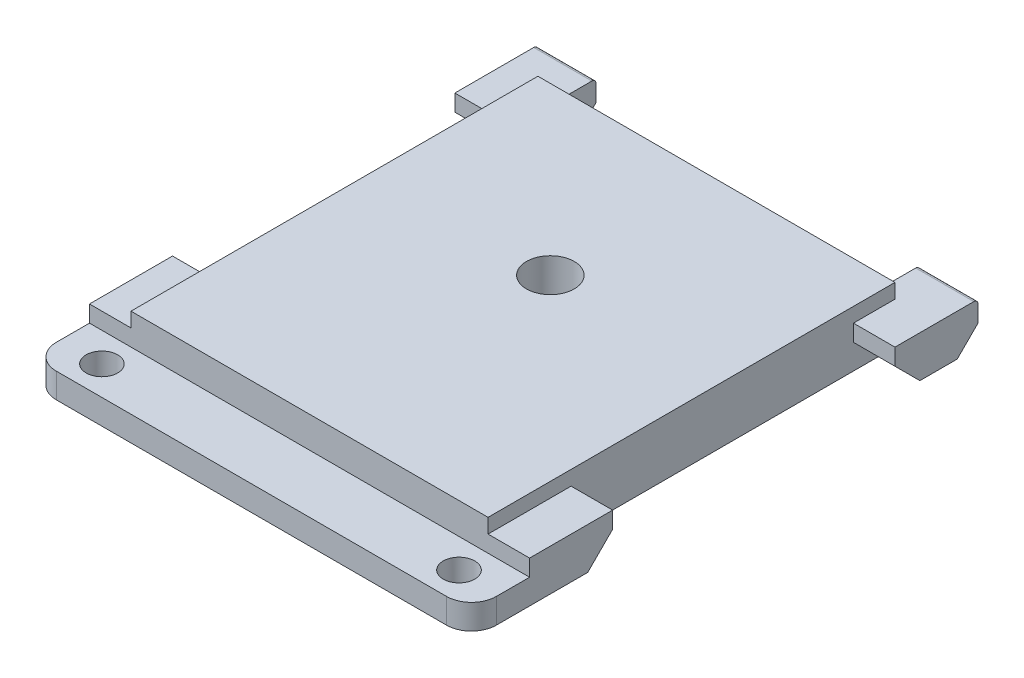
ISO-10303-21;
HEADER;
FILE_DESCRIPTION(('STEP AP214'),'2;1');
FILE_NAME('part.step','',(''),(''),'','','');
FILE_SCHEMA(('AUTOMOTIVE_DESIGN { 1 0 10303 214 1 1 1 1 }'));
ENDSEC;
DATA;
#1=APPLICATION_CONTEXT('core data for automotive mechanical design processes');
#2=APPLICATION_PROTOCOL_DEFINITION('international standard','automotive_design',2000,#1);
#3=PRODUCT_CONTEXT('',#1,'mechanical');
#4=PRODUCT('Part','Part','',(#3));
#5=PRODUCT_RELATED_PRODUCT_CATEGORY('part','',(#4));
#6=PRODUCT_DEFINITION_FORMATION('','',#4);
#7=PRODUCT_DEFINITION_CONTEXT('part definition',#1,'design');
#8=PRODUCT_DEFINITION('design','',#6,#7);
#9=PRODUCT_DEFINITION_SHAPE('','',#8);
#10=(LENGTH_UNIT() NAMED_UNIT(*) SI_UNIT(.MILLI.,.METRE.));
#11=(NAMED_UNIT(*) PLANE_ANGLE_UNIT() SI_UNIT($,.RADIAN.));
#12=(NAMED_UNIT(*) SI_UNIT($,.STERADIAN.) SOLID_ANGLE_UNIT());
#13=UNCERTAINTY_MEASURE_WITH_UNIT(LENGTH_MEASURE(1.E-05),#10,'distance_accuracy_value','');
#14=(GEOMETRIC_REPRESENTATION_CONTEXT(3) GLOBAL_UNCERTAINTY_ASSIGNED_CONTEXT((#13)) GLOBAL_UNIT_ASSIGNED_CONTEXT((#10,
#11,#12)) REPRESENTATION_CONTEXT('',''));
#15=CARTESIAN_POINT('',(0.,0.,0.));
#16=DIRECTION('',(0.,0.,1.));
#17=DIRECTION('',(1.,0.,0.));
#18=AXIS2_PLACEMENT_3D('',#15,#16,#17);
#19=CARTESIAN_POINT('',(0.,0.,0.));
#20=DIRECTION('',(0.,1.,0.));
#21=DIRECTION('',(0.,0.,1.));
#22=AXIS2_PLACEMENT_3D('',#19,#20,#21);
#23=PLANE('',#22);
#24=CARTESIAN_POINT('',(21.5,0.,20.));
#25=DIRECTION('',(0.,1.,0.));
#26=DIRECTION('',(0.,0.,1.));
#27=AXIS2_PLACEMENT_3D('',#24,#25,#26);
#28=CIRCLE('',#27,2.875);
#29=CARTESIAN_POINT('',(21.5,0.,22.875));
#30=VERTEX_POINT('',#29);
#31=EDGE_CURVE('E303',#30,#30,#28,.T.);
#32=ORIENTED_EDGE('',*,*,#31,.T.);
#33=EDGE_LOOP('',(#32));
#34=FACE_BOUND('',#33,.T.);
#35=CARTESIAN_POINT('',(0.,0.,52.5));
#36=DIRECTION('',(0.,1.,0.));
#37=DIRECTION('',(0.,0.,1.));
#38=AXIS2_PLACEMENT_3D('',#35,#36,#37);
#39=CIRCLE('',#38,1.9);
#40=CARTESIAN_POINT('',(0.,0.,54.4));
#41=VERTEX_POINT('',#40);
#42=EDGE_CURVE('E527',#41,#41,#39,.F.);
#43=ORIENTED_EDGE('',*,*,#42,.F.);
#44=EDGE_LOOP('',(#43));
#45=FACE_BOUND('',#44,.T.);
#46=CARTESIAN_POINT('',(43.,0.,52.5));
#47=DIRECTION('',(0.,1.,0.));
#48=DIRECTION('',(0.,0.,1.));
#49=AXIS2_PLACEMENT_3D('',#46,#47,#48);
#50=CIRCLE('',#49,1.9);
#51=CARTESIAN_POINT('',(43.,0.,54.4));
#52=VERTEX_POINT('',#51);
#53=EDGE_CURVE('E526',#52,#52,#50,.F.);
#54=ORIENTED_EDGE('',*,*,#53,.F.);
#55=EDGE_LOOP('',(#54));
#56=FACE_BOUND('',#55,.T.);
#57=DIRECTION('',(0.,0.,-1.));
#58=VECTOR('',#57,1.);
#59=CARTESIAN_POINT('',(48.,0.,49.));
#60=LINE('',#59,#58);
#61=CARTESIAN_POINT('',(48.,0.,53.));
#62=VERTEX_POINT('',#61);
#63=CARTESIAN_POINT('',(48.,0.,42.));
#64=VERTEX_POINT('',#63);
#65=EDGE_CURVE('E280',#62,#64,#60,.T.);
#66=ORIENTED_EDGE('',*,*,#65,.F.);
#67=CARTESIAN_POINT('',(45.,0.,53.));
#68=DIRECTION('',(0.,1.,0.));
#69=DIRECTION('',(0.,0.,1.));
#70=AXIS2_PLACEMENT_3D('',#67,#68,#69);
#71=CIRCLE('',#70,3.);
#72=CARTESIAN_POINT('',(45.,0.,56.));
#73=VERTEX_POINT('',#72);
#74=EDGE_CURVE('E47',#62,#73,#71,.F.);
#75=ORIENTED_EDGE('',*,*,#74,.T.);
#76=DIRECTION('',(1.,0.,0.));
#77=VECTOR('',#76,1.);
#78=CARTESIAN_POINT('',(-4.99999999999999,0.,56.));
#79=LINE('',#78,#77);
#80=CARTESIAN_POINT('',(-1.99999999999999,0.,56.));
#81=VERTEX_POINT('',#80);
#82=EDGE_CURVE('E425',#81,#73,#79,.T.);
#83=ORIENTED_EDGE('',*,*,#82,.F.);
#84=CARTESIAN_POINT('',(-1.99999999999999,0.,53.));
#85=DIRECTION('',(0.,1.,0.));
#86=DIRECTION('',(0.,0.,1.));
#87=AXIS2_PLACEMENT_3D('',#84,#85,#86);
#88=CIRCLE('',#87,3.);
#89=CARTESIAN_POINT('',(-4.99999999999999,0.,53.));
#90=VERTEX_POINT('',#89);
#91=EDGE_CURVE('E54',#81,#90,#88,.F.);
#92=ORIENTED_EDGE('',*,*,#91,.T.);
#93=DIRECTION('',(0.,0.,1.));
#94=VECTOR('',#93,1.);
#95=CARTESIAN_POINT('',(-5.,0.,0.));
#96=LINE('',#95,#94);
#97=CARTESIAN_POINT('',(-4.99999999999999,0.,42.));
#98=VERTEX_POINT('',#97);
#99=EDGE_CURVE('E291',#98,#90,#96,.T.);
#100=ORIENTED_EDGE('',*,*,#99,.F.);
#101=DIRECTION('',(1.,0.,0.));
#102=VECTOR('',#101,1.);
#103=CARTESIAN_POINT('',(0.,0.,42.));
#104=LINE('',#103,#102);
#105=CARTESIAN_POINT('',(0.,0.,42.));
#106=VERTEX_POINT('',#105);
#107=EDGE_CURVE('E388',#98,#106,#104,.T.);
#108=ORIENTED_EDGE('',*,*,#107,.T.);
#109=DIRECTION('',(0.,0.,1.));
#110=VECTOR('',#109,1.);
#111=CARTESIAN_POINT('',(0.,0.,5.00000000000001));
#112=LINE('',#111,#110);
#113=CARTESIAN_POINT('',(0.,0.,2.));
#114=VERTEX_POINT('',#113);
#115=EDGE_CURVE('E514',#114,#106,#112,.T.);
#116=ORIENTED_EDGE('',*,*,#115,.F.);
#117=DIRECTION('',(-1.,0.,0.));
#118=VECTOR('',#117,1.);
#119=CARTESIAN_POINT('',(0.,0.,2.));
#120=LINE('',#119,#118);
#121=CARTESIAN_POINT('',(-5.,0.,2.));
#122=VERTEX_POINT('',#121);
#123=EDGE_CURVE('E385',#114,#122,#120,.T.);
#124=ORIENTED_EDGE('',*,*,#123,.T.);
#125=CARTESIAN_POINT('',(-5.,0.,-2.5));
#126=VERTEX_POINT('',#125);
#127=EDGE_CURVE('E287',#126,#122,#96,.T.);
#128=ORIENTED_EDGE('',*,*,#127,.F.);
#129=DIRECTION('',(1.,0.,0.));
#130=VECTOR('',#129,1.);
#131=CARTESIAN_POINT('',(2.,0.,-2.5));
#132=LINE('',#131,#130);
#133=CARTESIAN_POINT('',(2.,0.,-2.5));
#134=VERTEX_POINT('',#133);
#135=EDGE_CURVE('E343',#126,#134,#132,.T.);
#136=ORIENTED_EDGE('',*,*,#135,.T.);
#137=DIRECTION('',(0.,0.,1.));
#138=VECTOR('',#137,1.);
#139=CARTESIAN_POINT('',(2.,0.,-5.));
#140=LINE('',#139,#138);
#141=CARTESIAN_POINT('',(2.,0.,0.));
#142=VERTEX_POINT('',#141);
#143=EDGE_CURVE('E458',#134,#142,#140,.T.);
#144=ORIENTED_EDGE('',*,*,#143,.T.);
#145=DIRECTION('',(1.,0.,0.));
#146=VECTOR('',#145,1.);
#147=CARTESIAN_POINT('',(0.,0.,0.));
#148=LINE('',#147,#146);
#149=CARTESIAN_POINT('',(41.,0.,0.));
#150=VERTEX_POINT('',#149);
#151=EDGE_CURVE('E308',#142,#150,#148,.T.);
#152=ORIENTED_EDGE('',*,*,#151,.T.);
#153=DIRECTION('',(0.,0.,1.));
#154=VECTOR('',#153,1.);
#155=CARTESIAN_POINT('',(41.,0.,-5.));
#156=LINE('',#155,#154);
#157=CARTESIAN_POINT('',(41.,0.,-2.5));
#158=VERTEX_POINT('',#157);
#159=EDGE_CURVE('E477',#158,#150,#156,.T.);
#160=ORIENTED_EDGE('',*,*,#159,.F.);
#161=DIRECTION('',(1.,0.,0.));
#162=VECTOR('',#161,1.);
#163=CARTESIAN_POINT('',(48.,0.,-2.5));
#164=LINE('',#163,#162);
#165=CARTESIAN_POINT('',(48.,0.,-2.5));
#166=VERTEX_POINT('',#165);
#167=EDGE_CURVE('E340',#158,#166,#164,.T.);
#168=ORIENTED_EDGE('',*,*,#167,.T.);
#169=CARTESIAN_POINT('',(48.,0.,1.99999999999999));
#170=VERTEX_POINT('',#169);
#171=EDGE_CURVE('E478',#170,#166,#60,.T.);
#172=ORIENTED_EDGE('',*,*,#171,.F.);
#173=DIRECTION('',(-1.,0.,0.));
#174=VECTOR('',#173,1.);
#175=CARTESIAN_POINT('',(43.,0.,2.));
#176=LINE('',#175,#174);
#177=CARTESIAN_POINT('',(43.,0.,2.));
#178=VERTEX_POINT('',#177);
#179=EDGE_CURVE('E382',#170,#178,#176,.T.);
#180=ORIENTED_EDGE('',*,*,#179,.T.);
#181=DIRECTION('',(0.,0.,-1.));
#182=VECTOR('',#181,1.);
#183=CARTESIAN_POINT('',(43.,0.,5.));
#184=LINE('',#183,#182);
#185=CARTESIAN_POINT('',(43.,0.,42.));
#186=VERTEX_POINT('',#185);
#187=EDGE_CURVE('E488',#186,#178,#184,.T.);
#188=ORIENTED_EDGE('',*,*,#187,.F.);
#189=DIRECTION('',(1.,0.,0.));
#190=VECTOR('',#189,1.);
#191=CARTESIAN_POINT('',(0.,0.,42.));
#192=LINE('',#191,#190);
#193=EDGE_CURVE('E379',#186,#64,#192,.T.);
#194=ORIENTED_EDGE('',*,*,#193,.T.);
#195=EDGE_LOOP('',(#66,#75,#83,#92,#100,#108,#116,#124,#128,#136,#144,#152,#160,#168,#172,#180,
#188,#194));
#196=FACE_BOUND('',#195,.T.);
#197=ADVANCED_FACE('F39',(#34,#45,#56,#196),#23,.F.);
#198=CARTESIAN_POINT('',(48.,5.,49.));
#199=DIRECTION('',(0.,-1.,0.));
#200=DIRECTION('',(0.,0.,-1.));
#201=AXIS2_PLACEMENT_3D('',#198,#199,#200);
#202=PLANE('',#201);
#203=DIRECTION('',(1.,0.,0.));
#204=VECTOR('',#203,1.);
#205=CARTESIAN_POINT('',(8.63431944512082,5.,5.));
#206=LINE('',#205,#204);
#207=CARTESIAN_POINT('',(43.,5.,5.));
#208=VERTEX_POINT('',#207);
#209=CARTESIAN_POINT('',(48.,5.,5.));
#210=VERTEX_POINT('',#209);
#211=EDGE_CURVE('E254',#208,#210,#206,.T.);
#212=ORIENTED_EDGE('',*,*,#211,.T.);
#213=DIRECTION('',(0.,0.,1.));
#214=VECTOR('',#213,1.);
#215=CARTESIAN_POINT('',(48.,5.,49.));
#216=LINE('',#215,#214);
#217=CARTESIAN_POINT('',(48.,5.,-4.5));
#218=VERTEX_POINT('',#217);
#219=EDGE_CURVE('E265',#218,#210,#216,.T.);
#220=ORIENTED_EDGE('',*,*,#219,.F.);
#221=DIRECTION('',(1.,0.,0.));
#222=VECTOR('',#221,1.);
#223=CARTESIAN_POINT('',(41.,5.,-4.5));
#224=LINE('',#223,#222);
#225=CARTESIAN_POINT('',(41.,5.,-4.5));
#226=VERTEX_POINT('',#225);
#227=EDGE_CURVE('E370',#218,#226,#224,.F.);
#228=ORIENTED_EDGE('',*,*,#227,.T.);
#229=DIRECTION('',(0.,0.,1.));
#230=VECTOR('',#229,1.);
#231=CARTESIAN_POINT('',(41.,5.,-5.));
#232=LINE('',#231,#230);
#233=CARTESIAN_POINT('',(41.,5.,0.));
#234=VERTEX_POINT('',#233);
#235=EDGE_CURVE('E472',#226,#234,#232,.T.);
#236=ORIENTED_EDGE('',*,*,#235,.T.);
#237=DIRECTION('',(1.,0.,0.));
#238=VECTOR('',#237,1.);
#239=CARTESIAN_POINT('',(48.,5.,0.));
#240=LINE('',#239,#238);
#241=CARTESIAN_POINT('',(43.,5.,0.));
#242=VERTEX_POINT('',#241);
#243=EDGE_CURVE('E469',#234,#242,#240,.T.);
#244=ORIENTED_EDGE('',*,*,#243,.T.);
#245=DIRECTION('',(0.,0.,1.));
#246=VECTOR('',#245,1.);
#247=CARTESIAN_POINT('',(43.,5.,49.));
#248=LINE('',#247,#246);
#249=EDGE_CURVE('E268',#242,#208,#248,.T.);
#250=ORIENTED_EDGE('',*,*,#249,.T.);
#251=EDGE_LOOP('',(#212,#220,#228,#236,#244,#250));
#252=FACE_BOUND('',#251,.T.);
#253=ADVANCED_FACE('F264',(#252),#202,.F.);
#254=CARTESIAN_POINT('',(48.,0.,0.));
#255=DIRECTION('',(-1.,0.,0.));
#256=DIRECTION('',(0.,0.,1.));
#257=AXIS2_PLACEMENT_3D('',#254,#255,#256);
#258=PLANE('',#257);
#259=DIRECTION('',(0.,-1.,0.));
#260=VECTOR('',#259,1.);
#261=CARTESIAN_POINT('',(48.,5.,5.));
#262=LINE('',#261,#260);
#263=CARTESIAN_POINT('',(48.,2.99999999999999,5.));
#264=VERTEX_POINT('',#263);
#265=EDGE_CURVE('E250',#210,#264,#262,.T.);
#266=ORIENTED_EDGE('',*,*,#265,.T.);
#267=DIRECTION('',(0.,-0.707106781186546,-0.707106781186549));
#268=VECTOR('',#267,1.);
#269=CARTESIAN_POINT('',(48.,2.99999999999999,5.));
#270=LINE('',#269,#268);
#271=EDGE_CURVE('E396',#264,#170,#270,.T.);
#272=ORIENTED_EDGE('',*,*,#271,.T.);
#273=ORIENTED_EDGE('',*,*,#171,.T.);
#274=DIRECTION('',(0.,0.707106781186547,-0.707106781186549));
#275=VECTOR('',#274,1.);
#276=CARTESIAN_POINT('',(48.,2.5,-5.));
#277=LINE('',#276,#275);
#278=CARTESIAN_POINT('',(48.,2.5,-5.));
#279=VERTEX_POINT('',#278);
#280=EDGE_CURVE('E353',#166,#279,#277,.T.);
#281=ORIENTED_EDGE('',*,*,#280,.T.);
#282=DIRECTION('',(0.,-1.,0.));
#283=VECTOR('',#282,1.);
#284=CARTESIAN_POINT('',(48.,5.,-5.));
#285=LINE('',#284,#283);
#286=CARTESIAN_POINT('',(48.,4.5,-5.));
#287=VERTEX_POINT('',#286);
#288=EDGE_CURVE('E466',#287,#279,#285,.T.);
#289=ORIENTED_EDGE('',*,*,#288,.F.);
#290=CARTESIAN_POINT('',(48.,4.5,-4.5));
#291=DIRECTION('',(-1.,0.,0.));
#292=DIRECTION('',(0.,0.,1.));
#293=AXIS2_PLACEMENT_3D('',#290,#291,#292);
#294=CIRCLE('',#293,0.5);
#295=EDGE_CURVE('E273',#287,#218,#294,.F.);
#296=ORIENTED_EDGE('',*,*,#295,.T.);
#297=ORIENTED_EDGE('',*,*,#219,.T.);
#298=EDGE_LOOP('',(#266,#272,#273,#281,#289,#296,#297));
#299=FACE_BOUND('',#298,.T.);
#300=ADVANCED_FACE('F271',(#299),#258,.F.);
#301=CARTESIAN_POINT('',(-5.,5.,0.));
#302=DIRECTION('',(0.,-1.,0.));
#303=DIRECTION('',(0.,0.,-1.));
#304=AXIS2_PLACEMENT_3D('',#301,#302,#303);
#305=PLANE('',#304);
#306=DIRECTION('',(0.,0.,-1.));
#307=VECTOR('',#306,1.);
#308=CARTESIAN_POINT('',(-5.,5.,0.));
#309=LINE('',#308,#307);
#310=CARTESIAN_POINT('',(-5.,5.,5.00000000000001));
#311=VERTEX_POINT('',#310);
#312=CARTESIAN_POINT('',(-5.,5.,-4.5));
#313=VERTEX_POINT('',#312);
#314=EDGE_CURVE('E293',#311,#313,#309,.T.);
#315=ORIENTED_EDGE('',*,*,#314,.F.);
#316=DIRECTION('',(-1.,0.,0.));
#317=VECTOR('',#316,1.);
#318=CARTESIAN_POINT('',(34.3656805548792,5.,5.));
#319=LINE('',#318,#317);
#320=CARTESIAN_POINT('',(0.,5.,5.00000000000001));
#321=VERTEX_POINT('',#320);
#322=EDGE_CURVE('E509',#321,#311,#319,.T.);
#323=ORIENTED_EDGE('',*,*,#322,.F.);
#324=DIRECTION('',(0.,0.,-1.));
#325=VECTOR('',#324,1.);
#326=CARTESIAN_POINT('',(0.,5.,0.));
#327=LINE('',#326,#325);
#328=CARTESIAN_POINT('',(0.,5.,0.));
#329=VERTEX_POINT('',#328);
#330=EDGE_CURVE('E278',#321,#329,#327,.T.);
#331=ORIENTED_EDGE('',*,*,#330,.T.);
#332=DIRECTION('',(1.,0.,0.));
#333=VECTOR('',#332,1.);
#334=CARTESIAN_POINT('',(-5.,5.,0.));
#335=LINE('',#334,#333);
#336=CARTESIAN_POINT('',(2.,5.,0.));
#337=VERTEX_POINT('',#336);
#338=EDGE_CURVE('E445',#329,#337,#335,.T.);
#339=ORIENTED_EDGE('',*,*,#338,.T.);
#340=DIRECTION('',(0.,0.,1.));
#341=VECTOR('',#340,1.);
#342=CARTESIAN_POINT('',(2.,5.,-5.));
#343=LINE('',#342,#341);
#344=CARTESIAN_POINT('',(2.,5.,-4.5));
#345=VERTEX_POINT('',#344);
#346=EDGE_CURVE('E463',#345,#337,#343,.T.);
#347=ORIENTED_EDGE('',*,*,#346,.F.);
#348=DIRECTION('',(1.,0.,0.));
#349=VECTOR('',#348,1.);
#350=CARTESIAN_POINT('',(-5.,5.,-4.5));
#351=LINE('',#350,#349);
#352=EDGE_CURVE('E361',#345,#313,#351,.F.);
#353=ORIENTED_EDGE('',*,*,#352,.T.);
#354=EDGE_LOOP('',(#315,#323,#331,#339,#347,#353));
#355=FACE_BOUND('',#354,.T.);
#356=ADVANCED_FACE('F875',(#355),#305,.F.);
#357=CARTESIAN_POINT('',(-5.,0.,0.));
#358=DIRECTION('',(1.,0.,0.));
#359=DIRECTION('',(0.,0.,-1.));
#360=AXIS2_PLACEMENT_3D('',#357,#358,#359);
#361=PLANE('',#360);
#362=ORIENTED_EDGE('',*,*,#127,.T.);
#363=DIRECTION('',(0.,-0.707106781186549,-0.707106781186546));
#364=VECTOR('',#363,1.);
#365=CARTESIAN_POINT('',(-5.,0.,2.));
#366=LINE('',#365,#364);
#367=CARTESIAN_POINT('',(-5.,3.00000000000002,5.00000000000001));
#368=VERTEX_POINT('',#367);
#369=EDGE_CURVE('E391',#122,#368,#366,.F.);
#370=ORIENTED_EDGE('',*,*,#369,.T.);
#371=DIRECTION('',(0.,-1.,0.));
#372=VECTOR('',#371,1.);
#373=CARTESIAN_POINT('',(-5.,5.,5.00000000000001));
#374=LINE('',#373,#372);
#375=EDGE_CURVE('E506',#311,#368,#374,.T.);
#376=ORIENTED_EDGE('',*,*,#375,.F.);
#377=ORIENTED_EDGE('',*,*,#314,.T.);
#378=CARTESIAN_POINT('',(-5.,4.5,-4.5));
#379=DIRECTION('',(1.,0.,0.));
#380=DIRECTION('',(0.,0.,-1.));
#381=AXIS2_PLACEMENT_3D('',#378,#379,#380);
#382=CIRCLE('',#381,0.5);
#383=CARTESIAN_POINT('',(-5.,4.5,-5.));
#384=VERTEX_POINT('',#383);
#385=EDGE_CURVE('E364',#313,#384,#382,.F.);
#386=ORIENTED_EDGE('',*,*,#385,.T.);
#387=DIRECTION('',(0.,1.,0.));
#388=VECTOR('',#387,1.);
#389=CARTESIAN_POINT('',(-5.,0.,-5.));
#390=LINE('',#389,#388);
#391=CARTESIAN_POINT('',(-5.,2.5,-5.));
#392=VERTEX_POINT('',#391);
#393=EDGE_CURVE('E454',#392,#384,#390,.T.);
#394=ORIENTED_EDGE('',*,*,#393,.F.);
#395=DIRECTION('',(0.,-0.707106781186547,0.707106781186549));
#396=VECTOR('',#395,1.);
#397=CARTESIAN_POINT('',(-5.,2.49999999999999,-5.));
#398=LINE('',#397,#396);
#399=EDGE_CURVE('E338',#392,#126,#398,.T.);
#400=ORIENTED_EDGE('',*,*,#399,.T.);
#401=EDGE_LOOP('',(#362,#370,#376,#377,#386,#394,#400));
#402=FACE_BOUND('',#401,.T.);
#403=ADVANCED_FACE('F566',(#402),#361,.F.);
#404=CARTESIAN_POINT('',(0.,6.75,49.));
#405=DIRECTION('',(0.,0.,-1.));
#406=DIRECTION('',(-1.,0.,0.));
#407=AXIS2_PLACEMENT_3D('',#404,#405,#406);
#408=PLANE('',#407);
#409=DIRECTION('',(-1.,0.,0.));
#410=VECTOR('',#409,1.);
#411=CARTESIAN_POINT('',(-4.99999999999999,3.,49.));
#412=LINE('',#411,#410);
#413=CARTESIAN_POINT('',(48.,3.,49.));
#414=VERTEX_POINT('',#413);
#415=CARTESIAN_POINT('',(-4.99999999999999,3.,49.));
#416=VERTEX_POINT('',#415);
#417=EDGE_CURVE('E434',#414,#416,#412,.T.);
#418=ORIENTED_EDGE('',*,*,#417,.F.);
#419=DIRECTION('',(0.,-1.,0.));
#420=VECTOR('',#419,1.);
#421=CARTESIAN_POINT('',(48.,0.,49.));
#422=LINE('',#421,#420);
#423=CARTESIAN_POINT('',(48.,5.,49.));
#424=VERTEX_POINT('',#423);
#425=EDGE_CURVE('E284',#424,#414,#422,.T.);
#426=ORIENTED_EDGE('',*,*,#425,.F.);
#427=DIRECTION('',(-1.,0.,0.));
#428=VECTOR('',#427,1.);
#429=CARTESIAN_POINT('',(48.,5.,49.));
#430=LINE('',#429,#428);
#431=CARTESIAN_POINT('',(43.,5.,49.));
#432=VERTEX_POINT('',#431);
#433=EDGE_CURVE('E274',#424,#432,#430,.T.);
#434=ORIENTED_EDGE('',*,*,#433,.T.);
#435=DIRECTION('',(0.,-1.,0.));
#436=VECTOR('',#435,1.);
#437=CARTESIAN_POINT('',(43.,6.75,49.));
#438=LINE('',#437,#436);
#439=CARTESIAN_POINT('',(43.,6.75,49.));
#440=VERTEX_POINT('',#439);
#441=EDGE_CURVE('E319',#440,#432,#438,.T.);
#442=ORIENTED_EDGE('',*,*,#441,.F.);
#443=DIRECTION('',(1.,0.,0.));
#444=VECTOR('',#443,1.);
#445=CARTESIAN_POINT('',(0.,6.75,49.));
#446=LINE('',#445,#444);
#447=CARTESIAN_POINT('',(0.,6.75,49.));
#448=VERTEX_POINT('',#447);
#449=EDGE_CURVE('E317',#448,#440,#446,.T.);
#450=ORIENTED_EDGE('',*,*,#449,.F.);
#451=DIRECTION('',(0.,-1.,0.));
#452=VECTOR('',#451,1.);
#453=CARTESIAN_POINT('',(0.,6.75,49.));
#454=LINE('',#453,#452);
#455=CARTESIAN_POINT('',(0.,5.,49.));
#456=VERTEX_POINT('',#455);
#457=EDGE_CURVE('E326',#448,#456,#454,.T.);
#458=ORIENTED_EDGE('',*,*,#457,.T.);
#459=DIRECTION('',(1.,0.,0.));
#460=VECTOR('',#459,1.);
#461=CARTESIAN_POINT('',(-4.99999999999999,5.,49.));
#462=LINE('',#461,#460);
#463=CARTESIAN_POINT('',(-4.99999999999999,5.,49.));
#464=VERTEX_POINT('',#463);
#465=EDGE_CURVE('E297',#464,#456,#462,.T.);
#466=ORIENTED_EDGE('',*,*,#465,.F.);
#467=DIRECTION('',(0.,1.,0.));
#468=VECTOR('',#467,1.);
#469=CARTESIAN_POINT('',(-4.99999999999999,0.,49.));
#470=LINE('',#469,#468);
#471=EDGE_CURVE('E290',#416,#464,#470,.T.);
#472=ORIENTED_EDGE('',*,*,#471,.F.);
#473=EDGE_LOOP('',(#418,#426,#434,#442,#450,#458,#466,#472));
#474=FACE_BOUND('',#473,.T.);
#475=ADVANCED_FACE('F538',(#474),#408,.F.);
#476=CARTESIAN_POINT('',(0.,6.75,0.));
#477=DIRECTION('',(0.,0.,-1.));
#478=DIRECTION('',(-1.,0.,0.));
#479=AXIS2_PLACEMENT_3D('',#476,#477,#478);
#480=PLANE('',#479);
#481=DIRECTION('',(0.,-1.,0.));
#482=VECTOR('',#481,1.);
#483=CARTESIAN_POINT('',(2.,0.,0.));
#484=LINE('',#483,#482);
#485=EDGE_CURVE('E449',#337,#142,#484,.T.);
#486=ORIENTED_EDGE('',*,*,#485,.F.);
#487=ORIENTED_EDGE('',*,*,#338,.F.);
#488=DIRECTION('',(0.,-1.,0.));
#489=VECTOR('',#488,1.);
#490=CARTESIAN_POINT('',(0.,6.75,0.));
#491=LINE('',#490,#489);
#492=CARTESIAN_POINT('',(0.,6.75,0.));
#493=VERTEX_POINT('',#492);
#494=EDGE_CURVE('E329',#493,#329,#491,.T.);
#495=ORIENTED_EDGE('',*,*,#494,.F.);
#496=DIRECTION('',(1.,0.,0.));
#497=VECTOR('',#496,1.);
#498=CARTESIAN_POINT('',(0.,6.75,0.));
#499=LINE('',#498,#497);
#500=CARTESIAN_POINT('',(43.,6.75,0.));
#501=VERTEX_POINT('',#500);
#502=EDGE_CURVE('E311',#493,#501,#499,.T.);
#503=ORIENTED_EDGE('',*,*,#502,.T.);
#504=DIRECTION('',(0.,-1.,0.));
#505=VECTOR('',#504,1.);
#506=CARTESIAN_POINT('',(43.,6.75,0.));
#507=LINE('',#506,#505);
#508=EDGE_CURVE('E332',#501,#242,#507,.T.);
#509=ORIENTED_EDGE('',*,*,#508,.T.);
#510=ORIENTED_EDGE('',*,*,#243,.F.);
#511=DIRECTION('',(0.,1.,0.));
#512=VECTOR('',#511,1.);
#513=CARTESIAN_POINT('',(41.,5.,0.));
#514=LINE('',#513,#512);
#515=EDGE_CURVE('E465',#150,#234,#514,.T.);
#516=ORIENTED_EDGE('',*,*,#515,.F.);
#517=ORIENTED_EDGE('',*,*,#151,.F.);
#518=EDGE_LOOP('',(#486,#487,#495,#503,#509,#510,#516,#517));
#519=FACE_BOUND('',#518,.T.);
#520=ADVANCED_FACE('F565',(#519),#480,.T.);
#521=CARTESIAN_POINT('',(0.,6.75,0.));
#522=DIRECTION('',(1.,0.,0.));
#523=DIRECTION('',(0.,0.,-1.));
#524=AXIS2_PLACEMENT_3D('',#521,#522,#523);
#525=PLANE('',#524);
#526=CARTESIAN_POINT('',(0.,5.,39.));
#527=VERTEX_POINT('',#526);
#528=EDGE_CURVE('E298',#456,#527,#327,.T.);
#529=ORIENTED_EDGE('',*,*,#528,.F.);
#530=ORIENTED_EDGE('',*,*,#457,.F.);
#531=DIRECTION('',(0.,0.,1.));
#532=VECTOR('',#531,1.);
#533=CARTESIAN_POINT('',(0.,6.75,0.));
#534=LINE('',#533,#532);
#535=EDGE_CURVE('E314',#493,#448,#534,.T.);
#536=ORIENTED_EDGE('',*,*,#535,.F.);
#537=ORIENTED_EDGE('',*,*,#494,.T.);
#538=ORIENTED_EDGE('',*,*,#330,.F.);
#539=DIRECTION('',(0.,-1.,0.));
#540=VECTOR('',#539,1.);
#541=CARTESIAN_POINT('',(0.,5.,5.00000000000001));
#542=LINE('',#541,#540);
#543=CARTESIAN_POINT('',(0.,3.00000000000002,5.00000000000001));
#544=VERTEX_POINT('',#543);
#545=EDGE_CURVE('E516',#321,#544,#542,.T.);
#546=ORIENTED_EDGE('',*,*,#545,.T.);
#547=DIRECTION('',(0.,0.707106781186549,0.707106781186546));
#548=VECTOR('',#547,1.);
#549=CARTESIAN_POINT('',(0.,2.37500000000001,4.37500000000001));
#550=LINE('',#549,#548);
#551=EDGE_CURVE('E404',#544,#114,#550,.F.);
#552=ORIENTED_EDGE('',*,*,#551,.T.);
#553=ORIENTED_EDGE('',*,*,#115,.T.);
#554=DIRECTION('',(0.,-0.707106781186546,0.70710678118655));
#555=VECTOR('',#554,1.);
#556=CARTESIAN_POINT('',(0.,24.375,17.6249999999999));
#557=LINE('',#556,#555);
#558=CARTESIAN_POINT('',(0.,3.00000000000001,39.));
#559=VERTEX_POINT('',#558);
#560=EDGE_CURVE('E402',#106,#559,#557,.F.);
#561=ORIENTED_EDGE('',*,*,#560,.T.);
#562=DIRECTION('',(0.,1.,0.));
#563=VECTOR('',#562,1.);
#564=CARTESIAN_POINT('',(0.,5.,39.));
#565=LINE('',#564,#563);
#566=EDGE_CURVE('E511',#559,#527,#565,.T.);
#567=ORIENTED_EDGE('',*,*,#566,.T.);
#568=EDGE_LOOP('',(#529,#530,#536,#537,#538,#546,#552,#553,#561,#567));
#569=FACE_BOUND('',#568,.T.);
#570=ADVANCED_FACE('F567',(#569),#525,.F.);
#571=CARTESIAN_POINT('',(43.,6.75,0.));
#572=DIRECTION('',(1.,0.,0.));
#573=DIRECTION('',(0.,0.,-1.));
#574=AXIS2_PLACEMENT_3D('',#571,#572,#573);
#575=PLANE('',#574);
#576=ORIENTED_EDGE('',*,*,#249,.F.);
#577=ORIENTED_EDGE('',*,*,#508,.F.);
#578=DIRECTION('',(0.,0.,1.));
#579=VECTOR('',#578,1.);
#580=CARTESIAN_POINT('',(43.,6.75,0.));
#581=LINE('',#580,#579);
#582=EDGE_CURVE('E307',#501,#440,#581,.T.);
#583=ORIENTED_EDGE('',*,*,#582,.T.);
#584=ORIENTED_EDGE('',*,*,#441,.T.);
#585=CARTESIAN_POINT('',(43.,5.,39.));
#586=VERTEX_POINT('',#585);
#587=EDGE_CURVE('E285',#586,#432,#248,.T.);
#588=ORIENTED_EDGE('',*,*,#587,.F.);
#589=DIRECTION('',(0.,1.,0.));
#590=VECTOR('',#589,1.);
#591=CARTESIAN_POINT('',(43.,5.,39.));
#592=LINE('',#591,#590);
#593=CARTESIAN_POINT('',(43.,3.00000000000002,39.));
#594=VERTEX_POINT('',#593);
#595=EDGE_CURVE('E493',#594,#586,#592,.T.);
#596=ORIENTED_EDGE('',*,*,#595,.F.);
#597=DIRECTION('',(0.,0.707106781186549,-0.707106781186546));
#598=VECTOR('',#597,1.);
#599=CARTESIAN_POINT('',(43.,0.,42.));
#600=LINE('',#599,#598);
#601=EDGE_CURVE('E409',#594,#186,#600,.F.);
#602=ORIENTED_EDGE('',*,*,#601,.T.);
#603=ORIENTED_EDGE('',*,*,#187,.T.);
#604=DIRECTION('',(0.,0.707106781186546,0.707106781186549));
#605=VECTOR('',#604,1.);
#606=CARTESIAN_POINT('',(43.,2.99999999999999,5.));
#607=LINE('',#606,#605);
#608=CARTESIAN_POINT('',(43.,2.99999999999999,5.));
#609=VERTEX_POINT('',#608);
#610=EDGE_CURVE('E407',#178,#609,#607,.T.);
#611=ORIENTED_EDGE('',*,*,#610,.T.);
#612=DIRECTION('',(0.,1.,0.));
#613=VECTOR('',#612,1.);
#614=CARTESIAN_POINT('',(43.,5.,5.));
#615=LINE('',#614,#613);
#616=EDGE_CURVE('E500',#609,#208,#615,.T.);
#617=ORIENTED_EDGE('',*,*,#616,.T.);
#618=EDGE_LOOP('',(#576,#577,#583,#584,#588,#596,#602,#603,#611,#617));
#619=FACE_BOUND('',#618,.T.);
#620=ADVANCED_FACE('F496',(#619),#575,.T.);
#621=CARTESIAN_POINT('',(21.5,6.75,20.));
#622=DIRECTION('',(0.,-1.,0.));
#623=DIRECTION('',(0.,0.,-1.));
#624=AXIS2_PLACEMENT_3D('',#621,#622,#623);
#625=CYLINDRICAL_SURFACE('',#624,2.875);
#626=CARTESIAN_POINT('',(21.5,6.75,20.));
#627=DIRECTION('',(0.,1.,0.));
#628=DIRECTION('',(0.,0.,1.));
#629=AXIS2_PLACEMENT_3D('',#626,#627,#628);
#630=CIRCLE('',#629,2.875);
#631=CARTESIAN_POINT('',(21.5,6.75,22.875));
#632=VERTEX_POINT('',#631);
#633=EDGE_CURVE('E304',#632,#632,#630,.T.);
#634=ORIENTED_EDGE('',*,*,#633,.T.);
#635=EDGE_LOOP('',(#634));
#636=FACE_BOUND('',#635,.T.);
#637=ORIENTED_EDGE('',*,*,#31,.F.);
#638=EDGE_LOOP('',(#637));
#639=FACE_BOUND('',#638,.T.);
#640=ADVANCED_FACE('F576',(#636,#639),#625,.F.);
#641=CARTESIAN_POINT('',(0.,6.75,0.));
#642=DIRECTION('',(0.,1.,0.));
#643=DIRECTION('',(0.,0.,1.));
#644=AXIS2_PLACEMENT_3D('',#641,#642,#643);
#645=PLANE('',#644);
#646=ORIENTED_EDGE('',*,*,#633,.F.);
#647=EDGE_LOOP('',(#646));
#648=FACE_BOUND('',#647,.T.);
#649=ORIENTED_EDGE('',*,*,#582,.F.);
#650=ORIENTED_EDGE('',*,*,#502,.F.);
#651=ORIENTED_EDGE('',*,*,#535,.T.);
#652=ORIENTED_EDGE('',*,*,#449,.T.);
#653=EDGE_LOOP('',(#649,#650,#651,#652));
#654=FACE_BOUND('',#653,.T.);
#655=ADVANCED_FACE('F561',(#648,#654),#645,.T.);
#656=ORIENTED_EDGE('',*,*,#528,.T.);
#657=DIRECTION('',(-1.,0.,0.));
#658=VECTOR('',#657,1.);
#659=CARTESIAN_POINT('',(34.3656805548792,5.,39.));
#660=LINE('',#659,#658);
#661=CARTESIAN_POINT('',(-4.99999999999999,5.,39.));
#662=VERTEX_POINT('',#661);
#663=EDGE_CURVE('E513',#527,#662,#660,.T.);
#664=ORIENTED_EDGE('',*,*,#663,.T.);
#665=EDGE_CURVE('E294',#464,#662,#309,.T.);
#666=ORIENTED_EDGE('',*,*,#665,.F.);
#667=ORIENTED_EDGE('',*,*,#465,.T.);
#668=EDGE_LOOP('',(#656,#664,#666,#667));
#669=FACE_BOUND('',#668,.T.);
#670=ADVANCED_FACE('F681',(#669),#305,.F.);
#671=ORIENTED_EDGE('',*,*,#99,.T.);
#672=DIRECTION('',(0.,-1.,0.));
#673=VECTOR('',#672,1.);
#674=CARTESIAN_POINT('',(-4.99999999999999,0.,53.));
#675=LINE('',#674,#673);
#676=CARTESIAN_POINT('',(-4.99999999999999,3.,53.));
#677=VERTEX_POINT('',#676);
#678=EDGE_CURVE('E11',#90,#677,#675,.F.);
#679=ORIENTED_EDGE('',*,*,#678,.T.);
#680=DIRECTION('',(0.,0.,-1.));
#681=VECTOR('',#680,1.);
#682=CARTESIAN_POINT('',(-4.99999999999999,3.,56.));
#683=LINE('',#682,#681);
#684=EDGE_CURVE('E446',#677,#416,#683,.T.);
#685=ORIENTED_EDGE('',*,*,#684,.T.);
#686=ORIENTED_EDGE('',*,*,#471,.T.);
#687=ORIENTED_EDGE('',*,*,#665,.T.);
#688=DIRECTION('',(0.,1.,0.));
#689=VECTOR('',#688,1.);
#690=CARTESIAN_POINT('',(-4.99999999999999,5.,39.));
#691=LINE('',#690,#689);
#692=CARTESIAN_POINT('',(-4.99999999999999,3.00000000000001,39.));
#693=VERTEX_POINT('',#692);
#694=EDGE_CURVE('E492',#693,#662,#691,.T.);
#695=ORIENTED_EDGE('',*,*,#694,.F.);
#696=DIRECTION('',(0.,0.707106781186546,-0.70710678118655));
#697=VECTOR('',#696,1.);
#698=CARTESIAN_POINT('',(-4.99999999999999,3.00000000000001,39.));
#699=LINE('',#698,#697);
#700=EDGE_CURVE('E377',#693,#98,#699,.F.);
#701=ORIENTED_EDGE('',*,*,#700,.T.);
#702=EDGE_LOOP('',(#671,#679,#685,#686,#687,#695,#701));
#703=FACE_BOUND('',#702,.T.);
#704=ADVANCED_FACE('F542',(#703),#361,.F.);
#705=CARTESIAN_POINT('',(48.,5.,39.));
#706=VERTEX_POINT('',#705);
#707=EDGE_CURVE('E275',#706,#424,#216,.T.);
#708=ORIENTED_EDGE('',*,*,#707,.F.);
#709=DIRECTION('',(1.,0.,0.));
#710=VECTOR('',#709,1.);
#711=CARTESIAN_POINT('',(8.63431944512083,5.,39.));
#712=LINE('',#711,#710);
#713=EDGE_CURVE('E269',#586,#706,#712,.T.);
#714=ORIENTED_EDGE('',*,*,#713,.F.);
#715=ORIENTED_EDGE('',*,*,#587,.T.);
#716=ORIENTED_EDGE('',*,*,#433,.F.);
#717=EDGE_LOOP('',(#708,#714,#715,#716));
#718=FACE_BOUND('',#717,.T.);
#719=ADVANCED_FACE('F557',(#718),#202,.F.);
#720=DIRECTION('',(0.,0.,-1.));
#721=VECTOR('',#720,1.);
#722=CARTESIAN_POINT('',(48.,3.,56.));
#723=LINE('',#722,#721);
#724=CARTESIAN_POINT('',(48.,3.,53.));
#725=VERTEX_POINT('',#724);
#726=EDGE_CURVE('E440',#725,#414,#723,.T.);
#727=ORIENTED_EDGE('',*,*,#726,.F.);
#728=DIRECTION('',(0.,1.,0.));
#729=VECTOR('',#728,1.);
#730=CARTESIAN_POINT('',(48.,0.,53.));
#731=LINE('',#730,#729);
#732=EDGE_CURVE('E62',#725,#62,#731,.F.);
#733=ORIENTED_EDGE('',*,*,#732,.T.);
#734=ORIENTED_EDGE('',*,*,#65,.T.);
#735=DIRECTION('',(0.,-0.707106781186549,0.707106781186546));
#736=VECTOR('',#735,1.);
#737=CARTESIAN_POINT('',(48.,0.,42.));
#738=LINE('',#737,#736);
#739=CARTESIAN_POINT('',(48.,3.00000000000002,39.));
#740=VERTEX_POINT('',#739);
#741=EDGE_CURVE('E398',#64,#740,#738,.F.);
#742=ORIENTED_EDGE('',*,*,#741,.T.);
#743=DIRECTION('',(0.,-1.,0.));
#744=VECTOR('',#743,1.);
#745=CARTESIAN_POINT('',(48.,5.,39.));
#746=LINE('',#745,#744);
#747=EDGE_CURVE('E260',#706,#740,#746,.T.);
#748=ORIENTED_EDGE('',*,*,#747,.F.);
#749=ORIENTED_EDGE('',*,*,#707,.T.);
#750=ORIENTED_EDGE('',*,*,#425,.T.);
#751=EDGE_LOOP('',(#727,#733,#734,#742,#748,#749,#750));
#752=FACE_BOUND('',#751,.T.);
#753=ADVANCED_FACE('F443',(#752),#258,.F.);
#754=CARTESIAN_POINT('',(41.,5.,-5.));
#755=DIRECTION('',(1.,0.,0.));
#756=DIRECTION('',(0.,0.,-1.));
#757=AXIS2_PLACEMENT_3D('',#754,#755,#756);
#758=PLANE('',#757);
#759=ORIENTED_EDGE('',*,*,#235,.F.);
#760=CARTESIAN_POINT('',(41.,4.5,-4.5));
#761=DIRECTION('',(1.,0.,0.));
#762=DIRECTION('',(0.,0.,-1.));
#763=AXIS2_PLACEMENT_3D('',#760,#761,#762);
#764=CIRCLE('',#763,0.5);
#765=CARTESIAN_POINT('',(41.,4.5,-5.));
#766=VERTEX_POINT('',#765);
#767=EDGE_CURVE('E372',#226,#766,#764,.F.);
#768=ORIENTED_EDGE('',*,*,#767,.T.);
#769=DIRECTION('',(0.,1.,0.));
#770=VECTOR('',#769,1.);
#771=CARTESIAN_POINT('',(41.,5.,-5.));
#772=LINE('',#771,#770);
#773=CARTESIAN_POINT('',(41.,2.5,-5.));
#774=VERTEX_POINT('',#773);
#775=EDGE_CURVE('E468',#774,#766,#772,.T.);
#776=ORIENTED_EDGE('',*,*,#775,.F.);
#777=DIRECTION('',(0.,-0.707106781186547,0.707106781186549));
#778=VECTOR('',#777,1.);
#779=CARTESIAN_POINT('',(41.,2.5,-5.));
#780=LINE('',#779,#778);
#781=EDGE_CURVE('E351',#774,#158,#780,.T.);
#782=ORIENTED_EDGE('',*,*,#781,.T.);
#783=ORIENTED_EDGE('',*,*,#159,.T.);
#784=ORIENTED_EDGE('',*,*,#515,.T.);
#785=EDGE_LOOP('',(#759,#768,#776,#782,#783,#784));
#786=FACE_BOUND('',#785,.T.);
#787=ADVANCED_FACE('F670',(#786),#758,.F.);
#788=CARTESIAN_POINT('',(0.,0.,-5.));
#789=DIRECTION('',(0.,0.,-1.));
#790=DIRECTION('',(-1.,0.,0.));
#791=AXIS2_PLACEMENT_3D('',#788,#789,#790);
#792=PLANE('',#791);
#793=ORIENTED_EDGE('',*,*,#775,.T.);
#794=DIRECTION('',(1.,0.,0.));
#795=VECTOR('',#794,1.);
#796=CARTESIAN_POINT('',(48.,4.5,-5.));
#797=LINE('',#796,#795);
#798=EDGE_CURVE('E366',#766,#287,#797,.T.);
#799=ORIENTED_EDGE('',*,*,#798,.T.);
#800=ORIENTED_EDGE('',*,*,#288,.T.);
#801=DIRECTION('',(-1.,0.,0.));
#802=VECTOR('',#801,1.);
#803=CARTESIAN_POINT('',(41.,2.5,-5.));
#804=LINE('',#803,#802);
#805=EDGE_CURVE('E348',#279,#774,#804,.T.);
#806=ORIENTED_EDGE('',*,*,#805,.T.);
#807=EDGE_LOOP('',(#793,#799,#800,#806));
#808=FACE_BOUND('',#807,.T.);
#809=ADVANCED_FACE('F810',(#808),#792,.T.);
#810=CARTESIAN_POINT('',(2.,0.,-5.));
#811=DIRECTION('',(-1.,0.,0.));
#812=DIRECTION('',(0.,0.,1.));
#813=AXIS2_PLACEMENT_3D('',#810,#811,#812);
#814=PLANE('',#813);
#815=DIRECTION('',(0.,-1.,0.));
#816=VECTOR('',#815,1.);
#817=CARTESIAN_POINT('',(2.,0.,-5.));
#818=LINE('',#817,#816);
#819=CARTESIAN_POINT('',(2.,4.5,-5.));
#820=VERTEX_POINT('',#819);
#821=CARTESIAN_POINT('',(2.,2.5,-5.));
#822=VERTEX_POINT('',#821);
#823=EDGE_CURVE('E457',#820,#822,#818,.T.);
#824=ORIENTED_EDGE('',*,*,#823,.F.);
#825=CARTESIAN_POINT('',(2.,4.5,-4.5));
#826=DIRECTION('',(-1.,0.,0.));
#827=DIRECTION('',(0.,0.,1.));
#828=AXIS2_PLACEMENT_3D('',#825,#826,#827);
#829=CIRCLE('',#828,0.5);
#830=EDGE_CURVE('E359',#820,#345,#829,.F.);
#831=ORIENTED_EDGE('',*,*,#830,.T.);
#832=ORIENTED_EDGE('',*,*,#346,.T.);
#833=ORIENTED_EDGE('',*,*,#485,.T.);
#834=ORIENTED_EDGE('',*,*,#143,.F.);
#835=DIRECTION('',(0.,0.707106781186547,-0.707106781186549));
#836=VECTOR('',#835,1.);
#837=CARTESIAN_POINT('',(2.,2.5,-5.));
#838=LINE('',#837,#836);
#839=EDGE_CURVE('E345',#134,#822,#838,.T.);
#840=ORIENTED_EDGE('',*,*,#839,.T.);
#841=EDGE_LOOP('',(#824,#831,#832,#833,#834,#840));
#842=FACE_BOUND('',#841,.T.);
#843=ADVANCED_FACE('F799',(#842),#814,.F.);
#844=CARTESIAN_POINT('',(0.,0.,-5.));
#845=DIRECTION('',(0.,0.,-1.));
#846=DIRECTION('',(-1.,0.,0.));
#847=AXIS2_PLACEMENT_3D('',#844,#845,#846);
#848=PLANE('',#847);
#849=ORIENTED_EDGE('',*,*,#393,.T.);
#850=DIRECTION('',(1.,0.,0.));
#851=VECTOR('',#850,1.);
#852=CARTESIAN_POINT('',(2.,4.5,-5.));
#853=LINE('',#852,#851);
#854=EDGE_CURVE('E356',#384,#820,#853,.T.);
#855=ORIENTED_EDGE('',*,*,#854,.T.);
#856=ORIENTED_EDGE('',*,*,#823,.T.);
#857=DIRECTION('',(-1.,0.,0.));
#858=VECTOR('',#857,1.);
#859=CARTESIAN_POINT('',(-5.,2.5,-5.));
#860=LINE('',#859,#858);
#861=EDGE_CURVE('E335',#822,#392,#860,.T.);
#862=ORIENTED_EDGE('',*,*,#861,.T.);
#863=EDGE_LOOP('',(#849,#855,#856,#862));
#864=FACE_BOUND('',#863,.T.);
#865=ADVANCED_FACE('F588',(#864),#848,.T.);
#866=CARTESIAN_POINT('',(0.,2.5,-5.));
#867=DIRECTION('',(0.,-0.707106781186548,-0.707106781186546));
#868=DIRECTION('',(1.,0.,0.));
#869=AXIS2_PLACEMENT_3D('',#866,#867,#868);
#870=PLANE('',#869);
#871=ORIENTED_EDGE('',*,*,#839,.F.);
#872=ORIENTED_EDGE('',*,*,#135,.F.);
#873=ORIENTED_EDGE('',*,*,#399,.F.);
#874=ORIENTED_EDGE('',*,*,#861,.F.);
#875=EDGE_LOOP('',(#871,#872,#873,#874));
#876=FACE_BOUND('',#875,.T.);
#877=ADVANCED_FACE('F581',(#876),#870,.T.);
#878=CARTESIAN_POINT('',(0.,2.5,-5.));
#879=DIRECTION('',(0.,-0.707106781186548,-0.707106781186546));
#880=DIRECTION('',(1.,0.,0.));
#881=AXIS2_PLACEMENT_3D('',#878,#879,#880);
#882=PLANE('',#881);
#883=ORIENTED_EDGE('',*,*,#280,.F.);
#884=ORIENTED_EDGE('',*,*,#167,.F.);
#885=ORIENTED_EDGE('',*,*,#781,.F.);
#886=ORIENTED_EDGE('',*,*,#805,.F.);
#887=EDGE_LOOP('',(#883,#884,#885,#886));
#888=FACE_BOUND('',#887,.T.);
#889=ADVANCED_FACE('F587',(#888),#882,.T.);
#890=CARTESIAN_POINT('',(0.,4.5,-4.5));
#891=DIRECTION('',(-1.,0.,0.));
#892=DIRECTION('',(0.,0.,1.));
#893=AXIS2_PLACEMENT_3D('',#890,#891,#892);
#894=CYLINDRICAL_SURFACE('',#893,0.5);
#895=ORIENTED_EDGE('',*,*,#385,.F.);
#896=ORIENTED_EDGE('',*,*,#352,.F.);
#897=ORIENTED_EDGE('',*,*,#830,.F.);
#898=ORIENTED_EDGE('',*,*,#854,.F.);
#899=EDGE_LOOP('',(#895,#896,#897,#898));
#900=FACE_BOUND('',#899,.T.);
#901=ADVANCED_FACE('F595',(#900),#894,.T.);
#902=CARTESIAN_POINT('',(0.,4.5,-4.5));
#903=DIRECTION('',(-1.,0.,0.));
#904=DIRECTION('',(0.,0.,1.));
#905=AXIS2_PLACEMENT_3D('',#902,#903,#904);
#906=CYLINDRICAL_SURFACE('',#905,0.5);
#907=ORIENTED_EDGE('',*,*,#767,.F.);
#908=ORIENTED_EDGE('',*,*,#227,.F.);
#909=ORIENTED_EDGE('',*,*,#295,.F.);
#910=ORIENTED_EDGE('',*,*,#798,.F.);
#911=EDGE_LOOP('',(#907,#908,#909,#910));
#912=FACE_BOUND('',#911,.T.);
#913=ADVANCED_FACE('F599',(#912),#906,.T.);
#914=CARTESIAN_POINT('',(-4.99999999999999,3.,56.));
#915=DIRECTION('',(0.,-1.,0.));
#916=DIRECTION('',(0.,0.,-1.));
#917=AXIS2_PLACEMENT_3D('',#914,#915,#916);
#918=PLANE('',#917);
#919=CARTESIAN_POINT('',(43.,3.,52.5));
#920=DIRECTION('',(0.,1.,0.));
#921=DIRECTION('',(0.,0.,-1.));
#922=AXIS2_PLACEMENT_3D('',#919,#920,#921);
#923=CIRCLE('',#922,1.9);
#924=CARTESIAN_POINT('',(43.,3.,50.6));
#925=VERTEX_POINT('',#924);
#926=EDGE_CURVE('E523',#925,#925,#923,.T.);
#927=ORIENTED_EDGE('',*,*,#926,.F.);
#928=EDGE_LOOP('',(#927));
#929=FACE_BOUND('',#928,.T.);
#930=CARTESIAN_POINT('',(0.,3.,52.5));
#931=DIRECTION('',(0.,1.,0.));
#932=DIRECTION('',(0.,0.,1.));
#933=AXIS2_PLACEMENT_3D('',#930,#931,#932);
#934=CIRCLE('',#933,1.9);
#935=CARTESIAN_POINT('',(0.,3.,54.4));
#936=VERTEX_POINT('',#935);
#937=EDGE_CURVE('E522',#936,#936,#934,.T.);
#938=ORIENTED_EDGE('',*,*,#937,.F.);
#939=EDGE_LOOP('',(#938));
#940=FACE_BOUND('',#939,.T.);
#941=DIRECTION('',(-1.,0.,0.));
#942=VECTOR('',#941,1.);
#943=CARTESIAN_POINT('',(-4.99999999999999,3.,56.));
#944=LINE('',#943,#942);
#945=CARTESIAN_POINT('',(45.,3.,56.));
#946=VERTEX_POINT('',#945);
#947=CARTESIAN_POINT('',(-1.99999999999999,3.,56.));
#948=VERTEX_POINT('',#947);
#949=EDGE_CURVE('E433',#946,#948,#944,.T.);
#950=ORIENTED_EDGE('',*,*,#949,.F.);
#951=CARTESIAN_POINT('',(45.,3.,53.));
#952=DIRECTION('',(0.,-1.,0.));
#953=DIRECTION('',(0.,0.,-1.));
#954=AXIS2_PLACEMENT_3D('',#951,#952,#953);
#955=CIRCLE('',#954,3.);
#956=EDGE_CURVE('E420',#946,#725,#955,.F.);
#957=ORIENTED_EDGE('',*,*,#956,.T.);
#958=ORIENTED_EDGE('',*,*,#726,.T.);
#959=ORIENTED_EDGE('',*,*,#417,.T.);
#960=ORIENTED_EDGE('',*,*,#684,.F.);
#961=CARTESIAN_POINT('',(-1.99999999999999,3.,53.));
#962=DIRECTION('',(0.,-1.,0.));
#963=DIRECTION('',(0.,0.,-1.));
#964=AXIS2_PLACEMENT_3D('',#961,#962,#963);
#965=CIRCLE('',#964,3.);
#966=EDGE_CURVE('E418',#677,#948,#965,.F.);
#967=ORIENTED_EDGE('',*,*,#966,.T.);
#968=EDGE_LOOP('',(#950,#957,#958,#959,#960,#967));
#969=FACE_BOUND('',#968,.T.);
#970=ADVANCED_FACE('F438',(#929,#940,#969),#918,.F.);
#971=CARTESIAN_POINT('',(0.,0.,56.));
#972=DIRECTION('',(0.,0.,-1.));
#973=DIRECTION('',(-1.,0.,0.));
#974=AXIS2_PLACEMENT_3D('',#971,#972,#973);
#975=PLANE('',#974);
#976=ORIENTED_EDGE('',*,*,#82,.T.);
#977=DIRECTION('',(0.,1.,0.));
#978=VECTOR('',#977,1.);
#979=CARTESIAN_POINT('',(45.,0.,56.));
#980=LINE('',#979,#978);
#981=EDGE_CURVE('E415',#73,#946,#980,.T.);
#982=ORIENTED_EDGE('',*,*,#981,.T.);
#983=ORIENTED_EDGE('',*,*,#949,.T.);
#984=DIRECTION('',(0.,-1.,0.));
#985=VECTOR('',#984,1.);
#986=CARTESIAN_POINT('',(-1.99999999999999,0.,56.));
#987=LINE('',#986,#985);
#988=EDGE_CURVE('E412',#948,#81,#987,.T.);
#989=ORIENTED_EDGE('',*,*,#988,.T.);
#990=EDGE_LOOP('',(#976,#982,#983,#989));
#991=FACE_BOUND('',#990,.T.);
#992=ADVANCED_FACE('F429',(#991),#975,.F.);
#993=CARTESIAN_POINT('',(0.,-5.37401153701776,52.5));
#994=DIRECTION('',(0.,1.,0.));
#995=DIRECTION('',(0.,0.,1.));
#996=AXIS2_PLACEMENT_3D('',#993,#994,#995);
#997=CYLINDRICAL_SURFACE('',#996,1.9);
#998=ORIENTED_EDGE('',*,*,#42,.T.);
#999=EDGE_LOOP('',(#998));
#1000=FACE_BOUND('',#999,.T.);
#1001=ORIENTED_EDGE('',*,*,#937,.T.);
#1002=EDGE_LOOP('',(#1001));
#1003=FACE_BOUND('',#1002,.T.);
#1004=ADVANCED_FACE('F650',(#1000,#1003),#997,.F.);
#1005=CARTESIAN_POINT('',(43.,-5.37401153701776,52.5));
#1006=DIRECTION('',(0.,1.,0.));
#1007=DIRECTION('',(0.,0.,1.));
#1008=AXIS2_PLACEMENT_3D('',#1005,#1006,#1007);
#1009=CYLINDRICAL_SURFACE('',#1008,1.9);
#1010=ORIENTED_EDGE('',*,*,#53,.T.);
#1011=EDGE_LOOP('',(#1010));
#1012=FACE_BOUND('',#1011,.T.);
#1013=ORIENTED_EDGE('',*,*,#926,.T.);
#1014=EDGE_LOOP('',(#1013));
#1015=FACE_BOUND('',#1014,.T.);
#1016=ADVANCED_FACE('F754',(#1012,#1015),#1009,.F.);
#1017=CARTESIAN_POINT('',(34.3656805548792,5.,5.));
#1018=DIRECTION('',(0.,0.,-1.));
#1019=DIRECTION('',(-1.,0.,0.));
#1020=AXIS2_PLACEMENT_3D('',#1017,#1018,#1019);
#1021=PLANE('',#1020);
#1022=ORIENTED_EDGE('',*,*,#375,.T.);
#1023=DIRECTION('',(1.,0.,0.));
#1024=VECTOR('',#1023,1.);
#1025=CARTESIAN_POINT('',(34.3656805548792,3.00000000000002,5.));
#1026=LINE('',#1025,#1024);
#1027=EDGE_CURVE('E393',#368,#544,#1026,.T.);
#1028=ORIENTED_EDGE('',*,*,#1027,.T.);
#1029=ORIENTED_EDGE('',*,*,#545,.F.);
#1030=ORIENTED_EDGE('',*,*,#322,.T.);
#1031=EDGE_LOOP('',(#1022,#1028,#1029,#1030));
#1032=FACE_BOUND('',#1031,.T.);
#1033=ADVANCED_FACE('F747',(#1032),#1021,.F.);
#1034=CARTESIAN_POINT('',(34.3656805548792,5.,39.));
#1035=DIRECTION('',(0.,0.,1.));
#1036=DIRECTION('',(1.,0.,0.));
#1037=AXIS2_PLACEMENT_3D('',#1034,#1035,#1036);
#1038=PLANE('',#1037);
#1039=ORIENTED_EDGE('',*,*,#566,.F.);
#1040=DIRECTION('',(-1.,0.,0.));
#1041=VECTOR('',#1040,1.);
#1042=CARTESIAN_POINT('',(34.3656805548792,3.00000000000001,39.));
#1043=LINE('',#1042,#1041);
#1044=EDGE_CURVE('E374',#559,#693,#1043,.T.);
#1045=ORIENTED_EDGE('',*,*,#1044,.T.);
#1046=ORIENTED_EDGE('',*,*,#694,.T.);
#1047=ORIENTED_EDGE('',*,*,#663,.F.);
#1048=EDGE_LOOP('',(#1039,#1045,#1046,#1047));
#1049=FACE_BOUND('',#1048,.T.);
#1050=ADVANCED_FACE('F714',(#1049),#1038,.F.);
#1051=CARTESIAN_POINT('',(8.63431944512082,5.,5.));
#1052=DIRECTION('',(0.,0.,1.));
#1053=DIRECTION('',(1.,0.,0.));
#1054=AXIS2_PLACEMENT_3D('',#1051,#1052,#1053);
#1055=PLANE('',#1054);
#1056=ORIENTED_EDGE('',*,*,#616,.F.);
#1057=DIRECTION('',(1.,0.,0.));
#1058=VECTOR('',#1057,1.);
#1059=CARTESIAN_POINT('',(48.,2.99999999999999,5.));
#1060=LINE('',#1059,#1058);
#1061=EDGE_CURVE('E257',#609,#264,#1060,.T.);
#1062=ORIENTED_EDGE('',*,*,#1061,.T.);
#1063=ORIENTED_EDGE('',*,*,#265,.F.);
#1064=ORIENTED_EDGE('',*,*,#211,.F.);
#1065=EDGE_LOOP('',(#1056,#1062,#1063,#1064));
#1066=FACE_BOUND('',#1065,.T.);
#1067=ADVANCED_FACE('F253',(#1066),#1055,.T.);
#1068=CARTESIAN_POINT('',(8.63431944512083,5.,39.));
#1069=DIRECTION('',(0.,0.,1.));
#1070=DIRECTION('',(1.,0.,0.));
#1071=AXIS2_PLACEMENT_3D('',#1068,#1069,#1070);
#1072=PLANE('',#1071);
#1073=ORIENTED_EDGE('',*,*,#747,.T.);
#1074=DIRECTION('',(-1.,0.,0.));
#1075=VECTOR('',#1074,1.);
#1076=CARTESIAN_POINT('',(8.63431944512083,3.00000000000002,39.));
#1077=LINE('',#1076,#1075);
#1078=EDGE_CURVE('E400',#740,#594,#1077,.T.);
#1079=ORIENTED_EDGE('',*,*,#1078,.T.);
#1080=ORIENTED_EDGE('',*,*,#595,.T.);
#1081=ORIENTED_EDGE('',*,*,#713,.T.);
#1082=EDGE_LOOP('',(#1073,#1079,#1080,#1081));
#1083=FACE_BOUND('',#1082,.T.);
#1084=ADVANCED_FACE('F611',(#1083),#1072,.F.);
#1085=CARTESIAN_POINT('',(34.3656805548792,3.00000000000001,39.));
#1086=DIRECTION('',(0.,0.70710678118655,0.707106781186546));
#1087=DIRECTION('',(-1.,0.,0.));
#1088=AXIS2_PLACEMENT_3D('',#1085,#1086,#1087);
#1089=PLANE('',#1088);
#1090=ORIENTED_EDGE('',*,*,#560,.F.);
#1091=ORIENTED_EDGE('',*,*,#107,.F.);
#1092=ORIENTED_EDGE('',*,*,#700,.F.);
#1093=ORIENTED_EDGE('',*,*,#1044,.F.);
#1094=EDGE_LOOP('',(#1090,#1091,#1092,#1093));
#1095=FACE_BOUND('',#1094,.T.);
#1096=ADVANCED_FACE('F604',(#1095),#1089,.F.);
#1097=CARTESIAN_POINT('',(0.,0.,2.));
#1098=DIRECTION('',(0.,0.707106781186546,-0.707106781186549));
#1099=DIRECTION('',(-1.,0.,0.));
#1100=AXIS2_PLACEMENT_3D('',#1097,#1098,#1099);
#1101=PLANE('',#1100);
#1102=ORIENTED_EDGE('',*,*,#551,.F.);
#1103=ORIENTED_EDGE('',*,*,#1027,.F.);
#1104=ORIENTED_EDGE('',*,*,#369,.F.);
#1105=ORIENTED_EDGE('',*,*,#123,.F.);
#1106=EDGE_LOOP('',(#1102,#1103,#1104,#1105));
#1107=FACE_BOUND('',#1106,.T.);
#1108=ADVANCED_FACE('F610',(#1107),#1101,.F.);
#1109=CARTESIAN_POINT('',(8.63431944512082,2.99999999999999,5.));
#1110=DIRECTION('',(0.,-0.707106781186549,0.707106781186546));
#1111=DIRECTION('',(-1.,0.,0.));
#1112=AXIS2_PLACEMENT_3D('',#1109,#1110,#1111);
#1113=PLANE('',#1112);
#1114=ORIENTED_EDGE('',*,*,#610,.F.);
#1115=ORIENTED_EDGE('',*,*,#179,.F.);
#1116=ORIENTED_EDGE('',*,*,#271,.F.);
#1117=ORIENTED_EDGE('',*,*,#1061,.F.);
#1118=EDGE_LOOP('',(#1114,#1115,#1116,#1117));
#1119=FACE_BOUND('',#1118,.T.);
#1120=ADVANCED_FACE('F618',(#1119),#1113,.T.);
#1121=CARTESIAN_POINT('',(0.,0.,42.));
#1122=DIRECTION('',(0.,0.707106781186546,0.707106781186549));
#1123=DIRECTION('',(1.,0.,0.));
#1124=AXIS2_PLACEMENT_3D('',#1121,#1122,#1123);
#1125=PLANE('',#1124);
#1126=ORIENTED_EDGE('',*,*,#601,.F.);
#1127=ORIENTED_EDGE('',*,*,#1078,.F.);
#1128=ORIENTED_EDGE('',*,*,#741,.F.);
#1129=ORIENTED_EDGE('',*,*,#193,.F.);
#1130=EDGE_LOOP('',(#1126,#1127,#1128,#1129));
#1131=FACE_BOUND('',#1130,.T.);
#1132=ADVANCED_FACE('F487',(#1131),#1125,.F.);
#1133=CARTESIAN_POINT('',(45.,0.,53.));
#1134=DIRECTION('',(0.,1.,0.));
#1135=DIRECTION('',(0.,0.,1.));
#1136=AXIS2_PLACEMENT_3D('',#1133,#1134,#1135);
#1137=CYLINDRICAL_SURFACE('',#1136,3.);
#1138=ORIENTED_EDGE('',*,*,#74,.F.);
#1139=ORIENTED_EDGE('',*,*,#732,.F.);
#1140=ORIENTED_EDGE('',*,*,#956,.F.);
#1141=ORIENTED_EDGE('',*,*,#981,.F.);
#1142=EDGE_LOOP('',(#1138,#1139,#1140,#1141));
#1143=FACE_BOUND('',#1142,.T.);
#1144=ADVANCED_FACE('F436',(#1143),#1137,.T.);
#1145=CARTESIAN_POINT('',(-1.99999999999999,0.,53.));
#1146=DIRECTION('',(0.,-1.,0.));
#1147=DIRECTION('',(0.,0.,-1.));
#1148=AXIS2_PLACEMENT_3D('',#1145,#1146,#1147);
#1149=CYLINDRICAL_SURFACE('',#1148,3.);
#1150=ORIENTED_EDGE('',*,*,#966,.F.);
#1151=ORIENTED_EDGE('',*,*,#678,.F.);
#1152=ORIENTED_EDGE('',*,*,#91,.F.);
#1153=ORIENTED_EDGE('',*,*,#988,.F.);
#1154=EDGE_LOOP('',(#1150,#1151,#1152,#1153));
#1155=FACE_BOUND('',#1154,.T.);
#1156=ADVANCED_FACE('F41',(#1155),#1149,.T.);
#1157=CLOSED_SHELL('',(#197,#253,#300,#356,#403,#475,#520,#570,#620,#640,#655,#670,#704,#719,
#753,#787,#809,#843,#865,#877,#889,#901,#913,#970,#992,#1004,#1016,#1033,#1050,#1067,#1084,
#1096,#1108,#1120,#1132,#1144,#1156));
#1158=MANIFOLD_SOLID_BREP('B2',#1157);
#1159=ADVANCED_BREP_SHAPE_REPRESENTATION('',(#18,#1158),#14);
#1160=SHAPE_DEFINITION_REPRESENTATION(#9,#1159);
ENDSEC;
END-ISO-10303-21;
